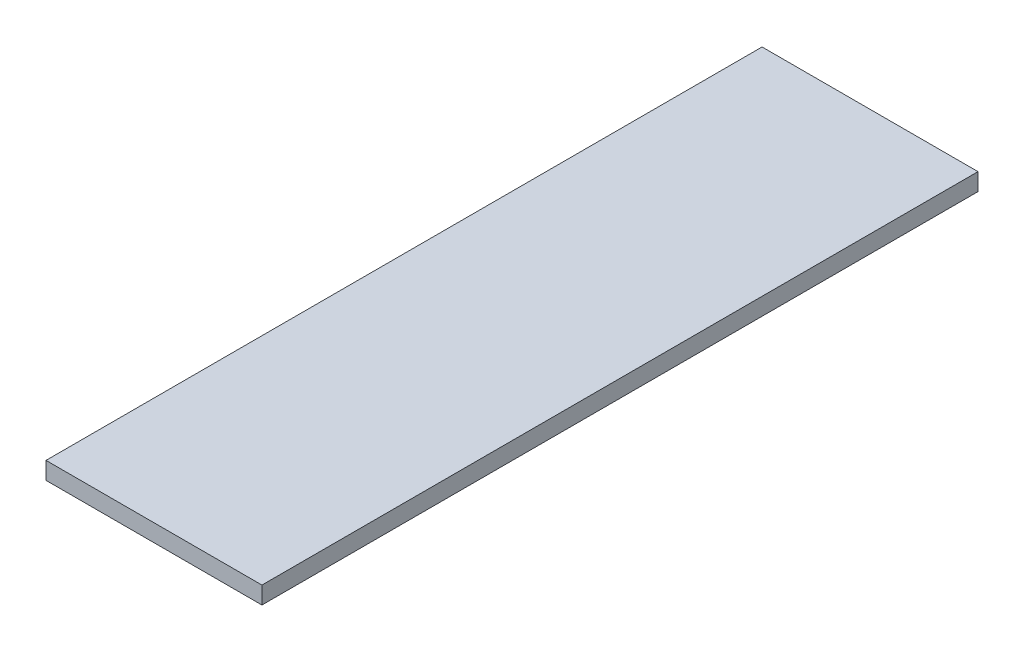
ISO-10303-21;
HEADER;
FILE_DESCRIPTION(('STEP AP214'),'2;1');
FILE_NAME('part.step','',(''),(''),'','','');
FILE_SCHEMA(('AUTOMOTIVE_DESIGN { 1 0 10303 214 1 1 1 1 }'));
ENDSEC;
DATA;
#1=APPLICATION_CONTEXT('core data for automotive mechanical design processes');
#2=APPLICATION_PROTOCOL_DEFINITION('international standard','automotive_design',2000,#1);
#3=PRODUCT_CONTEXT('',#1,'mechanical');
#4=PRODUCT('Part','Part','',(#3));
#5=PRODUCT_RELATED_PRODUCT_CATEGORY('part','',(#4));
#6=PRODUCT_DEFINITION_FORMATION('','',#4);
#7=PRODUCT_DEFINITION_CONTEXT('part definition',#1,'design');
#8=PRODUCT_DEFINITION('design','',#6,#7);
#9=PRODUCT_DEFINITION_SHAPE('','',#8);
#10=(LENGTH_UNIT() NAMED_UNIT(*) SI_UNIT(.MILLI.,.METRE.));
#11=(NAMED_UNIT(*) PLANE_ANGLE_UNIT() SI_UNIT($,.RADIAN.));
#12=(NAMED_UNIT(*) SI_UNIT($,.STERADIAN.) SOLID_ANGLE_UNIT());
#13=UNCERTAINTY_MEASURE_WITH_UNIT(LENGTH_MEASURE(1.E-05),#10,'distance_accuracy_value','');
#14=(GEOMETRIC_REPRESENTATION_CONTEXT(3) GLOBAL_UNCERTAINTY_ASSIGNED_CONTEXT((#13)) GLOBAL_UNIT_ASSIGNED_CONTEXT((#10,
#11,#12)) REPRESENTATION_CONTEXT('',''));
#15=CARTESIAN_POINT('',(0.,0.,0.));
#16=DIRECTION('',(0.,0.,1.));
#17=DIRECTION('',(1.,0.,0.));
#18=AXIS2_PLACEMENT_3D('',#15,#16,#17);
#19=CARTESIAN_POINT('',(-18.6968557711749,16.,-2.));
#20=DIRECTION('',(1.,0.,0.));
#21=DIRECTION('',(0.,1.,0.));
#22=AXIS2_PLACEMENT_3D('',#19,#20,#21);
#23=PLANE('',#22);
#24=DIRECTION('',(0.,0.,1.));
#25=VECTOR('',#24,1.);
#26=CARTESIAN_POINT('',(-18.6968557711749,13.,-2.));
#27=LINE('',#26,#25);
#28=CARTESIAN_POINT('',(-18.6968557711749,13.,-2.));
#29=VERTEX_POINT('',#28);
#30=CARTESIAN_POINT('',(-18.6968557711749,13.,122.));
#31=VERTEX_POINT('',#30);
#32=EDGE_CURVE('E95',#29,#31,#27,.T.);
#33=ORIENTED_EDGE('',*,*,#32,.T.);
#34=DIRECTION('',(0.,-1.,0.));
#35=VECTOR('',#34,1.);
#36=CARTESIAN_POINT('',(-18.6968557711749,16.,122.));
#37=LINE('',#36,#35);
#38=CARTESIAN_POINT('',(-18.6968557711749,16.,122.));
#39=VERTEX_POINT('',#38);
#40=EDGE_CURVE('E11',#39,#31,#37,.T.);
#41=ORIENTED_EDGE('',*,*,#40,.F.);
#42=DIRECTION('',(0.,0.,1.));
#43=VECTOR('',#42,1.);
#44=CARTESIAN_POINT('',(-18.6968557711749,16.,-2.));
#45=LINE('',#44,#43);
#46=CARTESIAN_POINT('',(-18.6968557711749,16.,-2.));
#47=VERTEX_POINT('',#46);
#48=EDGE_CURVE('E83',#47,#39,#45,.T.);
#49=ORIENTED_EDGE('',*,*,#48,.F.);
#50=DIRECTION('',(0.,-1.,0.));
#51=VECTOR('',#50,1.);
#52=CARTESIAN_POINT('',(-18.6968557711749,16.,-2.));
#53=LINE('',#52,#51);
#54=EDGE_CURVE('E91',#47,#29,#53,.T.);
#55=ORIENTED_EDGE('',*,*,#54,.T.);
#56=EDGE_LOOP('',(#33,#41,#49,#55));
#57=FACE_BOUND('',#56,.T.);
#58=ADVANCED_FACE('F32',(#57),#23,.F.);
#59=CARTESIAN_POINT('',(-18.6968557711749,16.,122.));
#60=DIRECTION('',(0.,0.,-1.));
#61=DIRECTION('',(-1.,0.,0.));
#62=AXIS2_PLACEMENT_3D('',#59,#60,#61);
#63=PLANE('',#62);
#64=DIRECTION('',(1.,0.,0.));
#65=VECTOR('',#64,1.);
#66=CARTESIAN_POINT('',(-18.6968557711749,13.,122.));
#67=LINE('',#66,#65);
#68=CARTESIAN_POINT('',(18.6968557711749,13.,122.));
#69=VERTEX_POINT('',#68);
#70=EDGE_CURVE('E87',#31,#69,#67,.T.);
#71=ORIENTED_EDGE('',*,*,#70,.T.);
#72=DIRECTION('',(0.,-1.,0.));
#73=VECTOR('',#72,1.);
#74=CARTESIAN_POINT('',(18.6968557711749,16.,122.));
#75=LINE('',#74,#73);
#76=CARTESIAN_POINT('',(18.6968557711749,16.,122.));
#77=VERTEX_POINT('',#76);
#78=EDGE_CURVE('E40',#77,#69,#75,.T.);
#79=ORIENTED_EDGE('',*,*,#78,.F.);
#80=DIRECTION('',(1.,0.,0.));
#81=VECTOR('',#80,1.);
#82=CARTESIAN_POINT('',(-18.6968557711749,16.,122.));
#83=LINE('',#82,#81);
#84=EDGE_CURVE('E78',#39,#77,#83,.T.);
#85=ORIENTED_EDGE('',*,*,#84,.F.);
#86=ORIENTED_EDGE('',*,*,#40,.T.);
#87=EDGE_LOOP('',(#71,#79,#85,#86));
#88=FACE_BOUND('',#87,.T.);
#89=ADVANCED_FACE('F86',(#88),#63,.F.);
#90=CARTESIAN_POINT('',(18.6968557711749,16.,-2.));
#91=DIRECTION('',(-1.,0.,0.));
#92=DIRECTION('',(0.,-1.,0.));
#93=AXIS2_PLACEMENT_3D('',#90,#91,#92);
#94=PLANE('',#93);
#95=DIRECTION('',(0.,0.,-1.));
#96=VECTOR('',#95,1.);
#97=CARTESIAN_POINT('',(18.6968557711749,13.,-2.));
#98=LINE('',#97,#96);
#99=CARTESIAN_POINT('',(18.6968557711749,13.,-2.));
#100=VERTEX_POINT('',#99);
#101=EDGE_CURVE('E65',#69,#100,#98,.T.);
#102=ORIENTED_EDGE('',*,*,#101,.T.);
#103=DIRECTION('',(0.,-1.,0.));
#104=VECTOR('',#103,1.);
#105=CARTESIAN_POINT('',(18.6968557711749,16.,-2.));
#106=LINE('',#105,#104);
#107=CARTESIAN_POINT('',(18.6968557711749,16.,-2.));
#108=VERTEX_POINT('',#107);
#109=EDGE_CURVE('E88',#108,#100,#106,.T.);
#110=ORIENTED_EDGE('',*,*,#109,.F.);
#111=DIRECTION('',(0.,0.,-1.));
#112=VECTOR('',#111,1.);
#113=CARTESIAN_POINT('',(18.6968557711749,16.,-2.));
#114=LINE('',#113,#112);
#115=EDGE_CURVE('E81',#77,#108,#114,.T.);
#116=ORIENTED_EDGE('',*,*,#115,.F.);
#117=ORIENTED_EDGE('',*,*,#78,.T.);
#118=EDGE_LOOP('',(#102,#110,#116,#117));
#119=FACE_BOUND('',#118,.T.);
#120=ADVANCED_FACE('F89',(#119),#94,.F.);
#121=CARTESIAN_POINT('',(-18.6968557711749,16.,-2.));
#122=DIRECTION('',(0.,0.,1.));
#123=DIRECTION('',(1.,0.,0.));
#124=AXIS2_PLACEMENT_3D('',#121,#122,#123);
#125=PLANE('',#124);
#126=DIRECTION('',(-1.,0.,0.));
#127=VECTOR('',#126,1.);
#128=CARTESIAN_POINT('',(-18.6968557711749,13.,-2.));
#129=LINE('',#128,#127);
#130=EDGE_CURVE('E71',#100,#29,#129,.T.);
#131=ORIENTED_EDGE('',*,*,#130,.T.);
#132=ORIENTED_EDGE('',*,*,#54,.F.);
#133=DIRECTION('',(-1.,0.,0.));
#134=VECTOR('',#133,1.);
#135=CARTESIAN_POINT('',(-18.6968557711749,16.,-2.));
#136=LINE('',#135,#134);
#137=EDGE_CURVE('E48',#108,#47,#136,.T.);
#138=ORIENTED_EDGE('',*,*,#137,.F.);
#139=ORIENTED_EDGE('',*,*,#109,.T.);
#140=EDGE_LOOP('',(#131,#132,#138,#139));
#141=FACE_BOUND('',#140,.T.);
#142=ADVANCED_FACE('F102',(#141),#125,.F.);
#143=CARTESIAN_POINT('',(0.,16.,0.));
#144=DIRECTION('',(0.,1.,0.));
#145=DIRECTION('',(-1.,0.,0.));
#146=AXIS2_PLACEMENT_3D('',#143,#144,#145);
#147=PLANE('',#146);
#148=ORIENTED_EDGE('',*,*,#48,.T.);
#149=ORIENTED_EDGE('',*,*,#84,.T.);
#150=ORIENTED_EDGE('',*,*,#115,.T.);
#151=ORIENTED_EDGE('',*,*,#137,.T.);
#152=EDGE_LOOP('',(#148,#149,#150,#151));
#153=FACE_BOUND('',#152,.T.);
#154=ADVANCED_FACE('F79',(#153),#147,.T.);
#155=CARTESIAN_POINT('',(0.,13.,0.));
#156=DIRECTION('',(0.,1.,0.));
#157=DIRECTION('',(-1.,0.,0.));
#158=AXIS2_PLACEMENT_3D('',#155,#156,#157);
#159=PLANE('',#158);
#160=ORIENTED_EDGE('',*,*,#32,.F.);
#161=ORIENTED_EDGE('',*,*,#130,.F.);
#162=ORIENTED_EDGE('',*,*,#101,.F.);
#163=ORIENTED_EDGE('',*,*,#70,.F.);
#164=EDGE_LOOP('',(#160,#161,#162,#163));
#165=FACE_BOUND('',#164,.T.);
#166=ADVANCED_FACE('F105',(#165),#159,.F.);
#167=CLOSED_SHELL('',(#58,#89,#120,#142,#154,#166));
#168=MANIFOLD_SOLID_BREP('B2',#167);
#169=ADVANCED_BREP_SHAPE_REPRESENTATION('',(#18,#168),#14);
#170=SHAPE_DEFINITION_REPRESENTATION(#9,#169);
ENDSEC;
END-ISO-10303-21;
